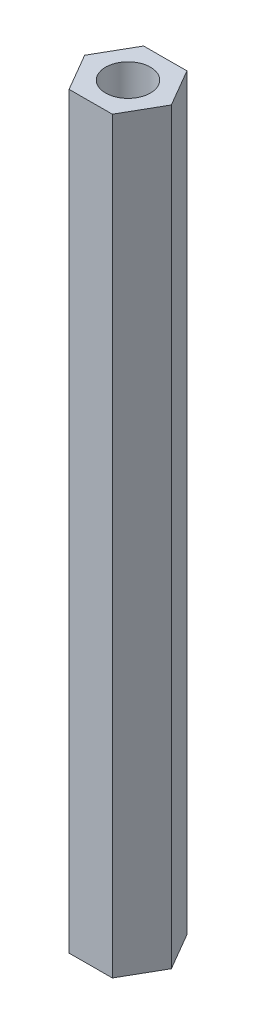
ISO-10303-21;
HEADER;
FILE_DESCRIPTION(('STEP AP214'),'2;1');
FILE_NAME('part.step','',(''),(''),'','','');
FILE_SCHEMA(('AUTOMOTIVE_DESIGN { 1 0 10303 214 1 1 1 1 }'));
ENDSEC;
DATA;
#1=APPLICATION_CONTEXT('core data for automotive mechanical design processes');
#2=APPLICATION_PROTOCOL_DEFINITION('international standard','automotive_design',2000,#1);
#3=PRODUCT_CONTEXT('',#1,'mechanical');
#4=PRODUCT('Part','Part','',(#3));
#5=PRODUCT_RELATED_PRODUCT_CATEGORY('part','',(#4));
#6=PRODUCT_DEFINITION_FORMATION('','',#4);
#7=PRODUCT_DEFINITION_CONTEXT('part definition',#1,'design');
#8=PRODUCT_DEFINITION('design','',#6,#7);
#9=PRODUCT_DEFINITION_SHAPE('','',#8);
#10=(LENGTH_UNIT() NAMED_UNIT(*) SI_UNIT(.MILLI.,.METRE.));
#11=(NAMED_UNIT(*) PLANE_ANGLE_UNIT() SI_UNIT($,.RADIAN.));
#12=(NAMED_UNIT(*) SI_UNIT($,.STERADIAN.) SOLID_ANGLE_UNIT());
#13=UNCERTAINTY_MEASURE_WITH_UNIT(LENGTH_MEASURE(1.E-05),#10,'distance_accuracy_value','');
#14=(GEOMETRIC_REPRESENTATION_CONTEXT(3) GLOBAL_UNCERTAINTY_ASSIGNED_CONTEXT((#13)) GLOBAL_UNIT_ASSIGNED_CONTEXT((#10,
#11,#12)) REPRESENTATION_CONTEXT('',''));
#15=CARTESIAN_POINT('',(0.,0.,0.));
#16=DIRECTION('',(0.,0.,1.));
#17=DIRECTION('',(1.,0.,0.));
#18=AXIS2_PLACEMENT_3D('',#15,#16,#17);
#19=CARTESIAN_POINT('',(2.88673711189656,50.,-0.00906532583217036));
#20=DIRECTION('',(-0.864450973076119,0.,0.502717132339599));
#21=DIRECTION('',(0.502717132339599,0.,0.86445097307612));
#22=AXIS2_PLACEMENT_3D('',#19,#20,#21);
#23=PLANE('',#22);
#24=DIRECTION('',(-0.502717132339599,0.,-0.86445097307612));
#25=VECTOR('',#24,1.);
#26=CARTESIAN_POINT('',(2.88673711189656,0.,-0.00906532583217036));
#27=LINE('',#26,#25);
#28=CARTESIAN_POINT('',(2.88673711189656,0.,-0.00906532583217036));
#29=VERTEX_POINT('',#28);
#30=CARTESIAN_POINT('',(1.43551775348404,0.,-2.50452033586583));
#31=VERTEX_POINT('',#30);
#32=EDGE_CURVE('E121',#29,#31,#27,.T.);
#33=ORIENTED_EDGE('',*,*,#32,.T.);
#34=DIRECTION('',(0.,-1.,0.));
#35=VECTOR('',#34,1.);
#36=CARTESIAN_POINT('',(1.43551775348404,50.,-2.50452033586583));
#37=LINE('',#36,#35);
#38=CARTESIAN_POINT('',(1.43551775348404,50.,-2.50452033586583));
#39=VERTEX_POINT('',#38);
#40=EDGE_CURVE('E11',#39,#31,#37,.T.);
#41=ORIENTED_EDGE('',*,*,#40,.F.);
#42=DIRECTION('',(-0.502717132339599,0.,-0.86445097307612));
#43=VECTOR('',#42,1.);
#44=CARTESIAN_POINT('',(2.88673711189656,50.,-0.00906532583217036));
#45=LINE('',#44,#43);
#46=CARTESIAN_POINT('',(2.88673711189656,50.,-0.00906532583217036));
#47=VERTEX_POINT('',#46);
#48=EDGE_CURVE('E132',#47,#39,#45,.T.);
#49=ORIENTED_EDGE('',*,*,#48,.F.);
#50=DIRECTION('',(0.,-1.,0.));
#51=VECTOR('',#50,1.);
#52=CARTESIAN_POINT('',(2.88673711189656,50.,-0.00906532583217036));
#53=LINE('',#52,#51);
#54=EDGE_CURVE('E117',#47,#29,#53,.T.);
#55=ORIENTED_EDGE('',*,*,#54,.T.);
#56=EDGE_LOOP('',(#33,#41,#49,#55));
#57=FACE_BOUND('',#56,.T.);
#58=ADVANCED_FACE('F37',(#57),#23,.F.);
#59=CARTESIAN_POINT('',(1.43551775348404,50.,-2.50452033586583));
#60=DIRECTION('',(0.00314032098569678,0.,0.999995069179897));
#61=DIRECTION('',(0.999995069179897,0.,-0.00314032098569678));
#62=AXIS2_PLACEMENT_3D('',#59,#60,#61);
#63=PLANE('',#62);
#64=DIRECTION('',(-0.999995069179897,0.,0.00314032098569678));
#65=VECTOR('',#64,1.);
#66=CARTESIAN_POINT('',(1.43551775348404,0.,-2.50452033586583));
#67=LINE('',#66,#65);
#68=CARTESIAN_POINT('',(-1.45121935841252,0.,-2.49545501003366));
#69=VERTEX_POINT('',#68);
#70=EDGE_CURVE('E124',#31,#69,#67,.T.);
#71=ORIENTED_EDGE('',*,*,#70,.T.);
#72=DIRECTION('',(0.,-1.,0.));
#73=VECTOR('',#72,1.);
#74=CARTESIAN_POINT('',(-1.45121935841252,50.,-2.49545501003366));
#75=LINE('',#74,#73);
#76=CARTESIAN_POINT('',(-1.45121935841252,50.,-2.49545501003366));
#77=VERTEX_POINT('',#76);
#78=EDGE_CURVE('E45',#77,#69,#75,.T.);
#79=ORIENTED_EDGE('',*,*,#78,.F.);
#80=DIRECTION('',(-0.999995069179897,0.,0.00314032098569678));
#81=VECTOR('',#80,1.);
#82=CARTESIAN_POINT('',(1.43551775348404,50.,-2.50452033586583));
#83=LINE('',#82,#81);
#84=EDGE_CURVE('E90',#39,#77,#83,.T.);
#85=ORIENTED_EDGE('',*,*,#84,.F.);
#86=ORIENTED_EDGE('',*,*,#40,.T.);
#87=EDGE_LOOP('',(#71,#79,#85,#86));
#88=FACE_BOUND('',#87,.T.);
#89=ADVANCED_FACE('F157',(#88),#63,.F.);
#90=CARTESIAN_POINT('',(-1.45121935841252,50.,-2.49545501003366));
#91=DIRECTION('',(0.867591294061816,0.,0.497277936840297));
#92=DIRECTION('',(0.497277936840297,0.,-0.867591294061816));
#93=AXIS2_PLACEMENT_3D('',#90,#91,#92);
#94=PLANE('',#93);
#95=DIRECTION('',(-0.497277936840297,0.,0.867591294061817));
#96=VECTOR('',#95,1.);
#97=CARTESIAN_POINT('',(-1.45121935841252,0.,-2.49545501003366));
#98=LINE('',#97,#96);
#99=CARTESIAN_POINT('',(-2.88673711189656,0.,0.00906532583217081));
#100=VERTEX_POINT('',#99);
#101=EDGE_CURVE('E127',#69,#100,#98,.T.);
#102=ORIENTED_EDGE('',*,*,#101,.T.);
#103=DIRECTION('',(0.,-1.,0.));
#104=VECTOR('',#103,1.);
#105=CARTESIAN_POINT('',(-2.88673711189656,50.,0.00906532583217081));
#106=LINE('',#105,#104);
#107=CARTESIAN_POINT('',(-2.88673711189656,50.,0.00906532583217081));
#108=VERTEX_POINT('',#107);
#109=EDGE_CURVE('E112',#108,#100,#106,.T.);
#110=ORIENTED_EDGE('',*,*,#109,.F.);
#111=DIRECTION('',(-0.497277936840297,0.,0.867591294061817));
#112=VECTOR('',#111,1.);
#113=CARTESIAN_POINT('',(-1.45121935841252,50.,-2.49545501003366));
#114=LINE('',#113,#112);
#115=EDGE_CURVE('E103',#77,#108,#114,.T.);
#116=ORIENTED_EDGE('',*,*,#115,.F.);
#117=ORIENTED_EDGE('',*,*,#78,.T.);
#118=EDGE_LOOP('',(#102,#110,#116,#117));
#119=FACE_BOUND('',#118,.T.);
#120=ADVANCED_FACE('F138',(#119),#94,.F.);
#121=CARTESIAN_POINT('',(-2.88673711189656,50.,0.00906532583217081));
#122=DIRECTION('',(0.864450973076119,0.,-0.5027171323396));
#123=DIRECTION('',(-0.5027171323396,0.,-0.864450973076119));
#124=AXIS2_PLACEMENT_3D('',#121,#122,#123);
#125=PLANE('',#124);
#126=DIRECTION('',(0.5027171323396,0.,0.864450973076119));
#127=VECTOR('',#126,1.);
#128=CARTESIAN_POINT('',(-2.88673711189656,0.,0.00906532583217081));
#129=LINE('',#128,#127);
#130=CARTESIAN_POINT('',(-1.43551775348404,0.,2.50452033586583));
#131=VERTEX_POINT('',#130);
#132=EDGE_CURVE('E111',#100,#131,#129,.T.);
#133=ORIENTED_EDGE('',*,*,#132,.T.);
#134=DIRECTION('',(0.,-1.,0.));
#135=VECTOR('',#134,1.);
#136=CARTESIAN_POINT('',(-1.43551775348404,50.,2.50452033586583));
#137=LINE('',#136,#135);
#138=CARTESIAN_POINT('',(-1.43551775348404,50.,2.50452033586583));
#139=VERTEX_POINT('',#138);
#140=EDGE_CURVE('E108',#139,#131,#137,.T.);
#141=ORIENTED_EDGE('',*,*,#140,.F.);
#142=DIRECTION('',(0.5027171323396,0.,0.864450973076119));
#143=VECTOR('',#142,1.);
#144=CARTESIAN_POINT('',(-2.88673711189656,50.,0.00906532583217081));
#145=LINE('',#144,#143);
#146=EDGE_CURVE('E97',#108,#139,#145,.T.);
#147=ORIENTED_EDGE('',*,*,#146,.F.);
#148=ORIENTED_EDGE('',*,*,#109,.T.);
#149=EDGE_LOOP('',(#133,#141,#147,#148));
#150=FACE_BOUND('',#149,.T.);
#151=ADVANCED_FACE('F109',(#150),#125,.F.);
#152=CARTESIAN_POINT('',(-1.43551775348404,50.,2.50452033586583));
#153=DIRECTION('',(-0.00314032098569694,0.,-0.999995069179897));
#154=DIRECTION('',(-0.999995069179897,0.,0.00314032098569694));
#155=AXIS2_PLACEMENT_3D('',#152,#153,#154);
#156=PLANE('',#155);
#157=DIRECTION('',(0.999995069179897,0.,-0.00314032098569694));
#158=VECTOR('',#157,1.);
#159=CARTESIAN_POINT('',(-1.43551775348404,0.,2.50452033586583));
#160=LINE('',#159,#158);
#161=CARTESIAN_POINT('',(1.45121935841252,0.,2.49545501003366));
#162=VERTEX_POINT('',#161);
#163=EDGE_CURVE('E76',#131,#162,#160,.T.);
#164=ORIENTED_EDGE('',*,*,#163,.T.);
#165=DIRECTION('',(0.,-1.,0.));
#166=VECTOR('',#165,1.);
#167=CARTESIAN_POINT('',(1.45121935841252,50.,2.49545501003366));
#168=LINE('',#167,#166);
#169=CARTESIAN_POINT('',(1.45121935841252,50.,2.49545501003366));
#170=VERTEX_POINT('',#169);
#171=EDGE_CURVE('E113',#170,#162,#168,.T.);
#172=ORIENTED_EDGE('',*,*,#171,.F.);
#173=DIRECTION('',(0.999995069179897,0.,-0.00314032098569694));
#174=VECTOR('',#173,1.);
#175=CARTESIAN_POINT('',(-1.43551775348404,50.,2.50452033586583));
#176=LINE('',#175,#174);
#177=EDGE_CURVE('E101',#139,#170,#176,.T.);
#178=ORIENTED_EDGE('',*,*,#177,.F.);
#179=ORIENTED_EDGE('',*,*,#140,.T.);
#180=EDGE_LOOP('',(#164,#172,#178,#179));
#181=FACE_BOUND('',#180,.T.);
#182=ADVANCED_FACE('F115',(#181),#156,.F.);
#183=CARTESIAN_POINT('',(1.45121935841252,50.,2.49545501003366));
#184=DIRECTION('',(-0.867591294061816,0.,-0.497277936840297));
#185=DIRECTION('',(-0.497277936840297,0.,0.867591294061816));
#186=AXIS2_PLACEMENT_3D('',#183,#184,#185);
#187=PLANE('',#186);
#188=DIRECTION('',(0.497277936840297,0.,-0.867591294061816));
#189=VECTOR('',#188,1.);
#190=CARTESIAN_POINT('',(1.45121935841252,0.,2.49545501003366));
#191=LINE('',#190,#189);
#192=EDGE_CURVE('E82',#162,#29,#191,.T.);
#193=ORIENTED_EDGE('',*,*,#192,.T.);
#194=ORIENTED_EDGE('',*,*,#54,.F.);
#195=DIRECTION('',(0.497277936840297,0.,-0.867591294061816));
#196=VECTOR('',#195,1.);
#197=CARTESIAN_POINT('',(1.45121935841252,50.,2.49545501003366));
#198=LINE('',#197,#196);
#199=EDGE_CURVE('E53',#170,#47,#198,.T.);
#200=ORIENTED_EDGE('',*,*,#199,.F.);
#201=ORIENTED_EDGE('',*,*,#171,.T.);
#202=EDGE_LOOP('',(#193,#194,#200,#201));
#203=FACE_BOUND('',#202,.T.);
#204=ADVANCED_FACE('F145',(#203),#187,.F.);
#205=CARTESIAN_POINT('',(0.,50.,0.));
#206=DIRECTION('',(0.,1.,0.));
#207=DIRECTION('',(0.,0.,1.));
#208=AXIS2_PLACEMENT_3D('',#205,#206,#207);
#209=PLANE('',#208);
#210=CARTESIAN_POINT('',(0.,50.,0.));
#211=DIRECTION('',(0.,1.,0.));
#212=DIRECTION('',(0.,0.,1.));
#213=AXIS2_PLACEMENT_3D('',#210,#211,#212);
#214=CIRCLE('',#213,1.5);
#215=CARTESIAN_POINT('',(0.,50.,1.5));
#216=VERTEX_POINT('',#215);
#217=EDGE_CURVE('E244',#216,#216,#214,.T.);
#218=ORIENTED_EDGE('',*,*,#217,.F.);
#219=EDGE_LOOP('',(#218));
#220=FACE_BOUND('',#219,.T.);
#221=ORIENTED_EDGE('',*,*,#48,.T.);
#222=ORIENTED_EDGE('',*,*,#84,.T.);
#223=ORIENTED_EDGE('',*,*,#115,.T.);
#224=ORIENTED_EDGE('',*,*,#146,.T.);
#225=ORIENTED_EDGE('',*,*,#177,.T.);
#226=ORIENTED_EDGE('',*,*,#199,.T.);
#227=EDGE_LOOP('',(#221,#222,#223,#224,#225,#226));
#228=FACE_BOUND('',#227,.T.);
#229=ADVANCED_FACE('F99',(#220,#228),#209,.T.);
#230=CARTESIAN_POINT('',(0.,0.,0.));
#231=DIRECTION('',(0.,1.,0.));
#232=DIRECTION('',(0.,0.,1.));
#233=AXIS2_PLACEMENT_3D('',#230,#231,#232);
#234=PLANE('',#233);
#235=CARTESIAN_POINT('',(0.,0.,0.));
#236=DIRECTION('',(0.,1.,0.));
#237=DIRECTION('',(0.,0.,1.));
#238=AXIS2_PLACEMENT_3D('',#235,#236,#237);
#239=CIRCLE('',#238,1.5);
#240=CARTESIAN_POINT('',(0.,0.,1.5));
#241=VERTEX_POINT('',#240);
#242=EDGE_CURVE('E125',#241,#241,#239,.T.);
#243=ORIENTED_EDGE('',*,*,#242,.T.);
#244=EDGE_LOOP('',(#243));
#245=FACE_BOUND('',#244,.T.);
#246=ORIENTED_EDGE('',*,*,#32,.F.);
#247=ORIENTED_EDGE('',*,*,#192,.F.);
#248=ORIENTED_EDGE('',*,*,#163,.F.);
#249=ORIENTED_EDGE('',*,*,#132,.F.);
#250=ORIENTED_EDGE('',*,*,#101,.F.);
#251=ORIENTED_EDGE('',*,*,#70,.F.);
#252=EDGE_LOOP('',(#246,#247,#248,#249,#250,#251));
#253=FACE_BOUND('',#252,.T.);
#254=ADVANCED_FACE('F141',(#245,#253),#234,.F.);
#255=CARTESIAN_POINT('',(0.,0.,0.));
#256=DIRECTION('',(0.,1.,0.));
#257=DIRECTION('',(0.,0.,1.));
#258=AXIS2_PLACEMENT_3D('',#255,#256,#257);
#259=CYLINDRICAL_SURFACE('',#258,1.5);
#260=ORIENTED_EDGE('',*,*,#242,.F.);
#261=EDGE_LOOP('',(#260));
#262=FACE_BOUND('',#261,.T.);
#263=ORIENTED_EDGE('',*,*,#217,.T.);
#264=EDGE_LOOP('',(#263));
#265=FACE_BOUND('',#264,.T.);
#266=ADVANCED_FACE('F197',(#262,#265),#259,.F.);
#267=CLOSED_SHELL('',(#58,#89,#120,#151,#182,#204,#229,#254,#266));
#268=MANIFOLD_SOLID_BREP('B2',#267);
#269=ADVANCED_BREP_SHAPE_REPRESENTATION('',(#18,#268),#14);
#270=SHAPE_DEFINITION_REPRESENTATION(#9,#269);
ENDSEC;
END-ISO-10303-21;
